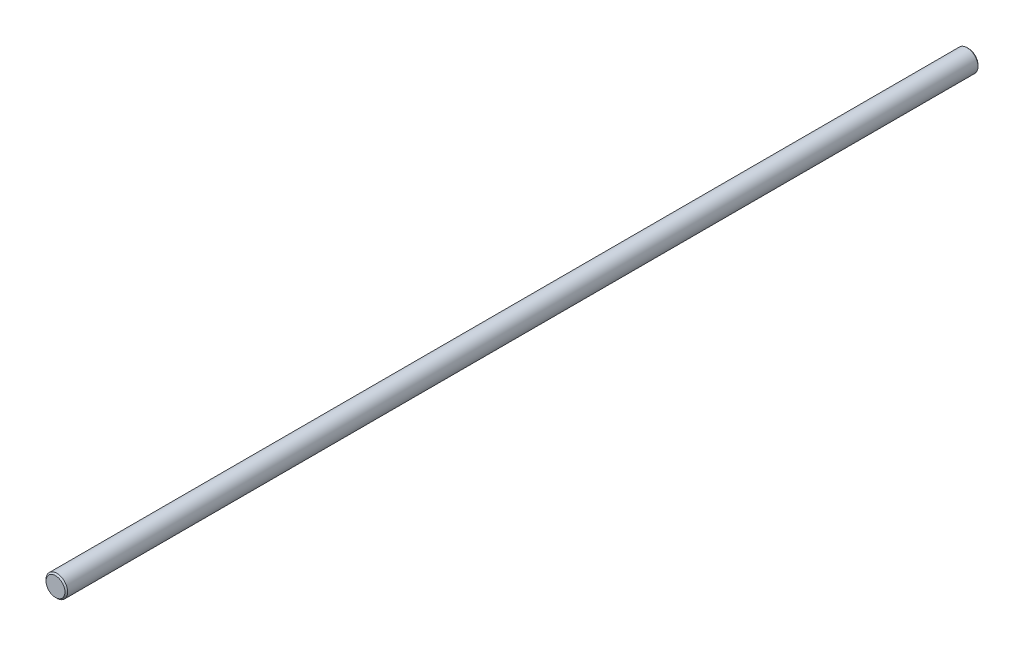
ISO-10303-21;
HEADER;
FILE_DESCRIPTION(('STEP AP214'),'2;1');
FILE_NAME('part.step','',(''),(''),'','','');
FILE_SCHEMA(('AUTOMOTIVE_DESIGN { 1 0 10303 214 1 1 1 1 }'));
ENDSEC;
DATA;
#1=APPLICATION_CONTEXT('core data for automotive mechanical design processes');
#2=APPLICATION_PROTOCOL_DEFINITION('international standard','automotive_design',2000,#1);
#3=PRODUCT_CONTEXT('',#1,'mechanical');
#4=PRODUCT('Part','Part','',(#3));
#5=PRODUCT_RELATED_PRODUCT_CATEGORY('part','',(#4));
#6=PRODUCT_DEFINITION_FORMATION('','',#4);
#7=PRODUCT_DEFINITION_CONTEXT('part definition',#1,'design');
#8=PRODUCT_DEFINITION('design','',#6,#7);
#9=PRODUCT_DEFINITION_SHAPE('','',#8);
#10=(LENGTH_UNIT() NAMED_UNIT(*) SI_UNIT(.MILLI.,.METRE.));
#11=(NAMED_UNIT(*) PLANE_ANGLE_UNIT() SI_UNIT($,.RADIAN.));
#12=(NAMED_UNIT(*) SI_UNIT($,.STERADIAN.) SOLID_ANGLE_UNIT());
#13=UNCERTAINTY_MEASURE_WITH_UNIT(LENGTH_MEASURE(1.E-05),#10,'distance_accuracy_value','');
#14=(GEOMETRIC_REPRESENTATION_CONTEXT(3) GLOBAL_UNCERTAINTY_ASSIGNED_CONTEXT((#13)) GLOBAL_UNIT_ASSIGNED_CONTEXT((#10,
#11,#12)) REPRESENTATION_CONTEXT('',''));
#15=CARTESIAN_POINT('',(0.,0.,0.));
#16=DIRECTION('',(0.,0.,1.));
#17=DIRECTION('',(1.,0.,0.));
#18=AXIS2_PLACEMENT_3D('',#15,#16,#17);
#19=CARTESIAN_POINT('',(0.,0.,-168.5));
#20=DIRECTION('',(0.,0.,1.));
#21=DIRECTION('',(1.,0.,0.));
#22=AXIS2_PLACEMENT_3D('',#19,#20,#21);
#23=PLANE('',#22);
#24=CARTESIAN_POINT('',(0.,0.,-168.500000000051));
#25=DIRECTION('',(0.,0.,1.));
#26=DIRECTION('',(1.,0.,0.));
#27=AXIS2_PLACEMENT_3D('',#24,#25,#26);
#28=CIRCLE('',#27,3.49999999997408);
#29=CARTESIAN_POINT('',(3.49999999997408,0.,-168.500000000051));
#30=VERTEX_POINT('',#29);
#31=EDGE_CURVE('E18',#30,#30,#28,.T.);
#32=ORIENTED_EDGE('',*,*,#31,.F.);
#33=EDGE_LOOP('',(#32));
#34=FACE_BOUND('',#33,.T.);
#35=ADVANCED_FACE('F15',(#34),#23,.F.);
#36=CARTESIAN_POINT('',(0.,0.,168.5));
#37=DIRECTION('',(0.,0.,1.));
#38=DIRECTION('',(1.,0.,0.));
#39=AXIS2_PLACEMENT_3D('',#36,#37,#38);
#40=PLANE('',#39);
#41=CARTESIAN_POINT('',(0.,0.,168.500000000051));
#42=DIRECTION('',(0.,0.,-1.));
#43=DIRECTION('',(-1.,0.,0.));
#44=AXIS2_PLACEMENT_3D('',#41,#42,#43);
#45=CIRCLE('',#44,3.49999999997408);
#46=CARTESIAN_POINT('',(-3.49999999997408,0.,168.500000000051));
#47=VERTEX_POINT('',#46);
#48=EDGE_CURVE('E27',#47,#47,#45,.T.);
#49=ORIENTED_EDGE('',*,*,#48,.F.);
#50=EDGE_LOOP('',(#49));
#51=FACE_BOUND('',#50,.T.);
#52=ADVANCED_FACE('F42',(#51),#40,.T.);
#53=CARTESIAN_POINT('',(0.,0.,-168.00000000012));
#54=DIRECTION('',(0.,0.,1.));
#55=DIRECTION('',(1.,0.,0.));
#56=AXIS2_PLACEMENT_3D('',#53,#54,#55);
#57=CONICAL_SURFACE('',#56,3.99999999990541,0.785398163397448);
#58=CARTESIAN_POINT('',(0.,0.,-168.));
#59=DIRECTION('',(0.,0.,1.));
#60=DIRECTION('',(1.,0.,0.));
#61=AXIS2_PLACEMENT_3D('',#58,#59,#60);
#62=CIRCLE('',#61,4.);
#63=CARTESIAN_POINT('',(4.,0.,-168.));
#64=VERTEX_POINT('',#63);
#65=EDGE_CURVE('E22',#64,#64,#62,.T.);
#66=ORIENTED_EDGE('',*,*,#65,.F.);
#67=EDGE_LOOP('',(#66));
#68=FACE_BOUND('',#67,.T.);
#69=ORIENTED_EDGE('',*,*,#31,.T.);
#70=EDGE_LOOP('',(#69));
#71=FACE_BOUND('',#70,.T.);
#72=ADVANCED_FACE('F39',(#68,#71),#57,.T.);
#73=CARTESIAN_POINT('',(0.,0.,168.000000000063));
#74=DIRECTION('',(0.,0.,-1.));
#75=DIRECTION('',(-1.,0.,0.));
#76=AXIS2_PLACEMENT_3D('',#73,#74,#75);
#77=CONICAL_SURFACE('',#76,4.0000000000191,0.785398163454292);
#78=ORIENTED_EDGE('',*,*,#48,.T.);
#79=EDGE_LOOP('',(#78));
#80=FACE_BOUND('',#79,.T.);
#81=CARTESIAN_POINT('',(0.,0.,168.));
#82=DIRECTION('',(0.,0.,1.));
#83=DIRECTION('',(1.,0.,0.));
#84=AXIS2_PLACEMENT_3D('',#81,#82,#83);
#85=CIRCLE('',#84,4.);
#86=CARTESIAN_POINT('',(4.,0.,168.));
#87=VERTEX_POINT('',#86);
#88=EDGE_CURVE('E9',#87,#87,#85,.F.);
#89=ORIENTED_EDGE('',*,*,#88,.F.);
#90=EDGE_LOOP('',(#89));
#91=FACE_BOUND('',#90,.T.);
#92=ADVANCED_FACE('F49',(#80,#91),#77,.T.);
#93=CARTESIAN_POINT('',(0.,0.,-168.5));
#94=DIRECTION('',(0.,0.,1.));
#95=DIRECTION('',(1.,0.,0.));
#96=AXIS2_PLACEMENT_3D('',#93,#94,#95);
#97=CYLINDRICAL_SURFACE('',#96,4.);
#98=ORIENTED_EDGE('',*,*,#88,.T.);
#99=EDGE_LOOP('',(#98));
#100=FACE_BOUND('',#99,.T.);
#101=ORIENTED_EDGE('',*,*,#65,.T.);
#102=EDGE_LOOP('',(#101));
#103=FACE_BOUND('',#102,.T.);
#104=ADVANCED_FACE('F47',(#100,#103),#97,.T.);
#105=CLOSED_SHELL('',(#35,#52,#72,#92,#104));
#106=MANIFOLD_SOLID_BREP('B1',#105);
#107=ADVANCED_BREP_SHAPE_REPRESENTATION('',(#18,#106),#14);
#108=SHAPE_DEFINITION_REPRESENTATION(#9,#107);
ENDSEC;
END-ISO-10303-21;
